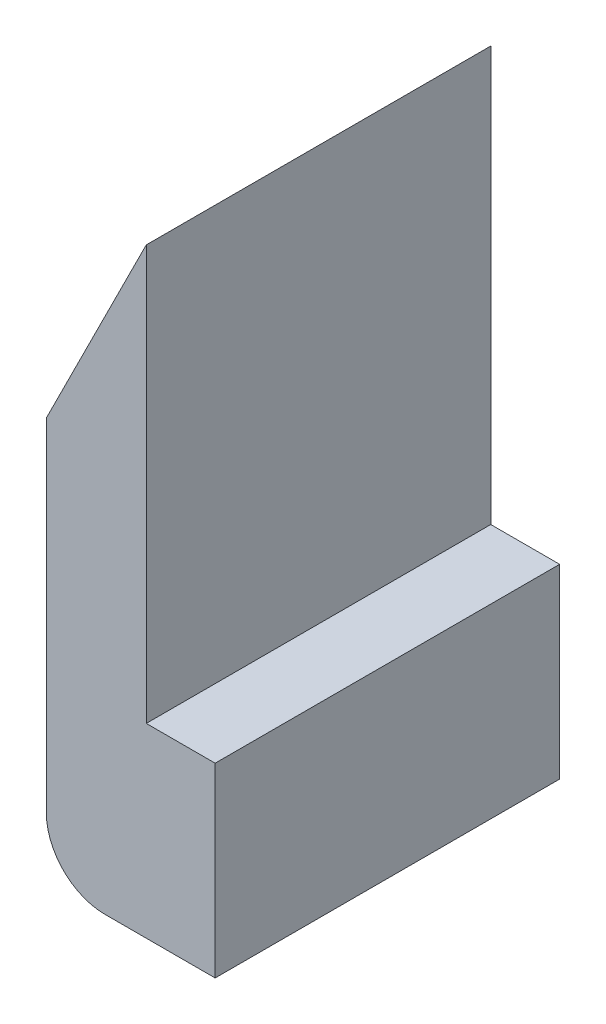
ISO-10303-21;
HEADER;
FILE_DESCRIPTION(('STEP AP214'),'2;1');
FILE_NAME('part.step','',(''),(''),'','','');
FILE_SCHEMA(('AUTOMOTIVE_DESIGN { 1 0 10303 214 1 1 1 1 }'));
ENDSEC;
DATA;
#1=APPLICATION_CONTEXT('core data for automotive mechanical design processes');
#2=APPLICATION_PROTOCOL_DEFINITION('international standard','automotive_design',2000,#1);
#3=PRODUCT_CONTEXT('',#1,'mechanical');
#4=PRODUCT('Part','Part','',(#3));
#5=PRODUCT_RELATED_PRODUCT_CATEGORY('part','',(#4));
#6=PRODUCT_DEFINITION_FORMATION('','',#4);
#7=PRODUCT_DEFINITION_CONTEXT('part definition',#1,'design');
#8=PRODUCT_DEFINITION('design','',#6,#7);
#9=PRODUCT_DEFINITION_SHAPE('','',#8);
#10=(LENGTH_UNIT() NAMED_UNIT(*) SI_UNIT(.MILLI.,.METRE.));
#11=(NAMED_UNIT(*) PLANE_ANGLE_UNIT() SI_UNIT($,.RADIAN.));
#12=(NAMED_UNIT(*) SI_UNIT($,.STERADIAN.) SOLID_ANGLE_UNIT());
#13=UNCERTAINTY_MEASURE_WITH_UNIT(LENGTH_MEASURE(1.E-05),#10,'distance_accuracy_value','');
#14=(GEOMETRIC_REPRESENTATION_CONTEXT(3) GLOBAL_UNCERTAINTY_ASSIGNED_CONTEXT((#13)) GLOBAL_UNIT_ASSIGNED_CONTEXT((#10,
#11,#12)) REPRESENTATION_CONTEXT('',''));
#15=CARTESIAN_POINT('',(0.,0.,0.));
#16=DIRECTION('',(0.,0.,1.));
#17=DIRECTION('',(1.,0.,0.));
#18=AXIS2_PLACEMENT_3D('',#15,#16,#17);
#19=CARTESIAN_POINT('',(-0.3,-0.3,10.));
#20=DIRECTION('',(-1.,0.,0.));
#21=DIRECTION('',(0.,0.,1.));
#22=AXIS2_PLACEMENT_3D('',#19,#20,#21);
#23=PLANE('',#22);
#24=DIRECTION('',(0.,1.,0.));
#25=VECTOR('',#24,1.);
#26=CARTESIAN_POINT('',(-0.3,-0.3,0.));
#27=LINE('',#26,#25);
#28=CARTESIAN_POINT('',(-0.3,-0.3,0.));
#29=VERTEX_POINT('',#28);
#30=CARTESIAN_POINT('',(-0.3,11.7291796067501,0.));
#31=VERTEX_POINT('',#30);
#32=EDGE_CURVE('E127',#29,#31,#27,.T.);
#33=ORIENTED_EDGE('',*,*,#32,.T.);
#34=DIRECTION('',(0.,0.,-1.));
#35=VECTOR('',#34,1.);
#36=CARTESIAN_POINT('',(-0.3,11.7291796067501,10.));
#37=LINE('',#36,#35);
#38=CARTESIAN_POINT('',(-0.3,11.7291796067501,10.));
#39=VERTEX_POINT('',#38);
#40=EDGE_CURVE('E11',#39,#31,#37,.T.);
#41=ORIENTED_EDGE('',*,*,#40,.F.);
#42=DIRECTION('',(0.,1.,0.));
#43=VECTOR('',#42,1.);
#44=CARTESIAN_POINT('',(-0.3,-0.3,10.));
#45=LINE('',#44,#43);
#46=CARTESIAN_POINT('',(-0.3,-0.3,10.));
#47=VERTEX_POINT('',#46);
#48=EDGE_CURVE('E140',#47,#39,#45,.T.);
#49=ORIENTED_EDGE('',*,*,#48,.F.);
#50=DIRECTION('',(0.,0.,-1.));
#51=VECTOR('',#50,1.);
#52=CARTESIAN_POINT('',(-0.3,-0.3,10.));
#53=LINE('',#52,#51);
#54=EDGE_CURVE('E123',#47,#29,#53,.T.);
#55=ORIENTED_EDGE('',*,*,#54,.T.);
#56=EDGE_LOOP('',(#33,#41,#49,#55));
#57=FACE_BOUND('',#56,.T.);
#58=ADVANCED_FACE('F38',(#57),#23,.F.);
#59=CARTESIAN_POINT('',(-0.3,11.7291796067501,10.));
#60=DIRECTION('',(0.894427190999916,-0.447213595499958,0.));
#61=DIRECTION('',(0.447213595499958,0.894427190999916,0.));
#62=AXIS2_PLACEMENT_3D('',#59,#60,#61);
#63=PLANE('',#62);
#64=DIRECTION('',(-0.447213595499958,-0.894427190999916,0.));
#65=VECTOR('',#64,1.);
#66=CARTESIAN_POINT('',(-0.3,11.7291796067501,0.));
#67=LINE('',#66,#65);
#68=CARTESIAN_POINT('',(-3.2,5.92917960675006,0.));
#69=VERTEX_POINT('',#68);
#70=EDGE_CURVE('E130',#31,#69,#67,.T.);
#71=ORIENTED_EDGE('',*,*,#70,.T.);
#72=DIRECTION('',(0.,0.,-1.));
#73=VECTOR('',#72,1.);
#74=CARTESIAN_POINT('',(-3.2,5.92917960675006,10.));
#75=LINE('',#74,#73);
#76=CARTESIAN_POINT('',(-3.2,5.92917960675006,10.));
#77=VERTEX_POINT('',#76);
#78=EDGE_CURVE('E46',#77,#69,#75,.T.);
#79=ORIENTED_EDGE('',*,*,#78,.F.);
#80=DIRECTION('',(-0.447213595499958,-0.894427190999916,0.));
#81=VECTOR('',#80,1.);
#82=CARTESIAN_POINT('',(-0.3,11.7291796067501,10.));
#83=LINE('',#82,#81);
#84=EDGE_CURVE('E94',#39,#77,#83,.T.);
#85=ORIENTED_EDGE('',*,*,#84,.F.);
#86=ORIENTED_EDGE('',*,*,#40,.T.);
#87=EDGE_LOOP('',(#71,#79,#85,#86));
#88=FACE_BOUND('',#87,.T.);
#89=ADVANCED_FACE('F165',(#88),#63,.F.);
#90=CARTESIAN_POINT('',(-3.2,-4.,10.));
#91=DIRECTION('',(1.,0.,0.));
#92=DIRECTION('',(0.,0.,-1.));
#93=AXIS2_PLACEMENT_3D('',#90,#91,#92);
#94=PLANE('',#93);
#95=DIRECTION('',(0.,-1.,0.));
#96=VECTOR('',#95,1.);
#97=CARTESIAN_POINT('',(-3.2,-4.,0.));
#98=LINE('',#97,#96);
#99=CARTESIAN_POINT('',(-3.2,-4.,0.));
#100=VERTEX_POINT('',#99);
#101=EDGE_CURVE('E132',#69,#100,#98,.T.);
#102=ORIENTED_EDGE('',*,*,#101,.T.);
#103=DIRECTION('',(0.,0.,-1.));
#104=VECTOR('',#103,1.);
#105=CARTESIAN_POINT('',(-3.2,-4.,10.));
#106=LINE('',#105,#104);
#107=CARTESIAN_POINT('',(-3.2,-4.,10.));
#108=VERTEX_POINT('',#107);
#109=EDGE_CURVE('E144',#108,#100,#106,.T.);
#110=ORIENTED_EDGE('',*,*,#109,.F.);
#111=DIRECTION('',(0.,-1.,0.));
#112=VECTOR('',#111,1.);
#113=CARTESIAN_POINT('',(-3.2,-4.,10.));
#114=LINE('',#113,#112);
#115=EDGE_CURVE('E152',#77,#108,#114,.T.);
#116=ORIENTED_EDGE('',*,*,#115,.F.);
#117=ORIENTED_EDGE('',*,*,#78,.T.);
#118=EDGE_LOOP('',(#102,#110,#116,#117));
#119=FACE_BOUND('',#118,.T.);
#120=ADVANCED_FACE('F150',(#119),#94,.F.);
#121=CARTESIAN_POINT('',(-1.5,-4.,10.));
#122=DIRECTION('',(0.,0.,-1.));
#123=DIRECTION('',(-1.,0.,0.));
#124=AXIS2_PLACEMENT_3D('',#121,#122,#123);
#125=CYLINDRICAL_SURFACE('',#124,1.7);
#126=CARTESIAN_POINT('',(-1.5,-4.,0.));
#127=DIRECTION('',(0.,0.,1.));
#128=DIRECTION('',(-1.,0.,0.));
#129=AXIS2_PLACEMENT_3D('',#126,#127,#128);
#130=CIRCLE('',#129,1.7);
#131=CARTESIAN_POINT('',(-1.5,-5.7,0.));
#132=VERTEX_POINT('',#131);
#133=EDGE_CURVE('E134',#100,#132,#130,.T.);
#134=ORIENTED_EDGE('',*,*,#133,.T.);
#135=DIRECTION('',(0.,0.,-1.));
#136=VECTOR('',#135,1.);
#137=CARTESIAN_POINT('',(-1.5,-5.7,10.));
#138=LINE('',#137,#136);
#139=CARTESIAN_POINT('',(-1.5,-5.7,10.));
#140=VERTEX_POINT('',#139);
#141=EDGE_CURVE('E118',#140,#132,#138,.T.);
#142=ORIENTED_EDGE('',*,*,#141,.F.);
#143=CARTESIAN_POINT('',(-1.5,-4.,10.));
#144=DIRECTION('',(0.,0.,1.));
#145=DIRECTION('',(-1.,0.,0.));
#146=AXIS2_PLACEMENT_3D('',#143,#144,#145);
#147=CIRCLE('',#146,1.7);
#148=EDGE_CURVE('E110',#108,#140,#147,.T.);
#149=ORIENTED_EDGE('',*,*,#148,.F.);
#150=ORIENTED_EDGE('',*,*,#109,.T.);
#151=EDGE_LOOP('',(#134,#142,#149,#150));
#152=FACE_BOUND('',#151,.T.);
#153=ADVANCED_FACE('F158',(#152),#125,.T.);
#154=CARTESIAN_POINT('',(1.7,-5.7,10.));
#155=DIRECTION('',(0.,1.,0.));
#156=DIRECTION('',(0.,0.,1.));
#157=AXIS2_PLACEMENT_3D('',#154,#155,#156);
#158=PLANE('',#157);
#159=DIRECTION('',(1.,0.,0.));
#160=VECTOR('',#159,1.);
#161=CARTESIAN_POINT('',(1.7,-5.7,0.));
#162=LINE('',#161,#160);
#163=CARTESIAN_POINT('',(1.7,-5.7,0.));
#164=VERTEX_POINT('',#163);
#165=EDGE_CURVE('E117',#132,#164,#162,.T.);
#166=ORIENTED_EDGE('',*,*,#165,.T.);
#167=DIRECTION('',(0.,0.,-1.));
#168=VECTOR('',#167,1.);
#169=CARTESIAN_POINT('',(1.7,-5.7,10.));
#170=LINE('',#169,#168);
#171=CARTESIAN_POINT('',(1.7,-5.7,10.));
#172=VERTEX_POINT('',#171);
#173=EDGE_CURVE('E115',#172,#164,#170,.T.);
#174=ORIENTED_EDGE('',*,*,#173,.F.);
#175=DIRECTION('',(1.,0.,0.));
#176=VECTOR('',#175,1.);
#177=CARTESIAN_POINT('',(0.,-5.7,10.));
#178=LINE('',#177,#176);
#179=EDGE_CURVE('E104',#140,#172,#178,.T.);
#180=ORIENTED_EDGE('',*,*,#179,.F.);
#181=ORIENTED_EDGE('',*,*,#141,.T.);
#182=EDGE_LOOP('',(#166,#174,#180,#181));
#183=FACE_BOUND('',#182,.T.);
#184=ADVANCED_FACE('F116',(#183),#158,.F.);
#185=CARTESIAN_POINT('',(1.7,-5.7,10.));
#186=DIRECTION('',(-1.,0.,0.));
#187=DIRECTION('',(0.,0.,1.));
#188=AXIS2_PLACEMENT_3D('',#185,#186,#187);
#189=PLANE('',#188);
#190=DIRECTION('',(0.,1.,0.));
#191=VECTOR('',#190,1.);
#192=CARTESIAN_POINT('',(1.7,-5.7,0.));
#193=LINE('',#192,#191);
#194=CARTESIAN_POINT('',(1.7,-0.3,0.));
#195=VERTEX_POINT('',#194);
#196=EDGE_CURVE('E80',#164,#195,#193,.T.);
#197=ORIENTED_EDGE('',*,*,#196,.T.);
#198=DIRECTION('',(0.,0.,-1.));
#199=VECTOR('',#198,1.);
#200=CARTESIAN_POINT('',(1.7,-0.3,10.));
#201=LINE('',#200,#199);
#202=CARTESIAN_POINT('',(1.7,-0.3,10.));
#203=VERTEX_POINT('',#202);
#204=EDGE_CURVE('E119',#203,#195,#201,.T.);
#205=ORIENTED_EDGE('',*,*,#204,.F.);
#206=DIRECTION('',(0.,1.,0.));
#207=VECTOR('',#206,1.);
#208=CARTESIAN_POINT('',(1.7,-5.7,10.));
#209=LINE('',#208,#207);
#210=EDGE_CURVE('E108',#172,#203,#209,.T.);
#211=ORIENTED_EDGE('',*,*,#210,.F.);
#212=ORIENTED_EDGE('',*,*,#173,.T.);
#213=EDGE_LOOP('',(#197,#205,#211,#212));
#214=FACE_BOUND('',#213,.T.);
#215=ADVANCED_FACE('F121',(#214),#189,.F.);
#216=CARTESIAN_POINT('',(1.7,-0.3,10.));
#217=DIRECTION('',(0.,-1.,0.));
#218=DIRECTION('',(0.,0.,-1.));
#219=AXIS2_PLACEMENT_3D('',#216,#217,#218);
#220=PLANE('',#219);
#221=DIRECTION('',(-1.,0.,0.));
#222=VECTOR('',#221,1.);
#223=CARTESIAN_POINT('',(1.7,-0.3,0.));
#224=LINE('',#223,#222);
#225=EDGE_CURVE('E86',#195,#29,#224,.T.);
#226=ORIENTED_EDGE('',*,*,#225,.T.);
#227=ORIENTED_EDGE('',*,*,#54,.F.);
#228=DIRECTION('',(-1.,0.,0.));
#229=VECTOR('',#228,1.);
#230=CARTESIAN_POINT('',(1.7,-0.3,10.));
#231=LINE('',#230,#229);
#232=EDGE_CURVE('E54',#203,#47,#231,.T.);
#233=ORIENTED_EDGE('',*,*,#232,.F.);
#234=ORIENTED_EDGE('',*,*,#204,.T.);
#235=EDGE_LOOP('',(#226,#227,#233,#234));
#236=FACE_BOUND('',#235,.T.);
#237=ADVANCED_FACE('F179',(#236),#220,.F.);
#238=CARTESIAN_POINT('',(-1.5,-4.,10.));
#239=DIRECTION('',(0.,0.,-1.));
#240=DIRECTION('',(-1.,0.,0.));
#241=AXIS2_PLACEMENT_3D('',#238,#239,#240);
#242=PLANE('',#241);
#243=ORIENTED_EDGE('',*,*,#48,.T.);
#244=ORIENTED_EDGE('',*,*,#84,.T.);
#245=ORIENTED_EDGE('',*,*,#115,.T.);
#246=ORIENTED_EDGE('',*,*,#148,.T.);
#247=ORIENTED_EDGE('',*,*,#179,.T.);
#248=ORIENTED_EDGE('',*,*,#210,.T.);
#249=ORIENTED_EDGE('',*,*,#232,.T.);
#250=EDGE_LOOP('',(#243,#244,#245,#246,#247,#248,#249));
#251=FACE_BOUND('',#250,.T.);
#252=ADVANCED_FACE('F106',(#251),#242,.F.);
#253=CARTESIAN_POINT('',(-1.5,-4.,0.));
#254=DIRECTION('',(0.,0.,-1.));
#255=DIRECTION('',(-1.,0.,0.));
#256=AXIS2_PLACEMENT_3D('',#253,#254,#255);
#257=PLANE('',#256);
#258=ORIENTED_EDGE('',*,*,#32,.F.);
#259=ORIENTED_EDGE('',*,*,#225,.F.);
#260=ORIENTED_EDGE('',*,*,#196,.F.);
#261=ORIENTED_EDGE('',*,*,#165,.F.);
#262=ORIENTED_EDGE('',*,*,#133,.F.);
#263=ORIENTED_EDGE('',*,*,#101,.F.);
#264=ORIENTED_EDGE('',*,*,#70,.F.);
#265=EDGE_LOOP('',(#258,#259,#260,#261,#262,#263,#264));
#266=FACE_BOUND('',#265,.T.);
#267=ADVANCED_FACE('F156',(#266),#257,.T.);
#268=CLOSED_SHELL('',(#58,#89,#120,#153,#184,#215,#237,#252,#267));
#269=MANIFOLD_SOLID_BREP('B2',#268);
#270=ADVANCED_BREP_SHAPE_REPRESENTATION('',(#18,#269),#14);
#271=SHAPE_DEFINITION_REPRESENTATION(#9,#270);
ENDSEC;
END-ISO-10303-21;
